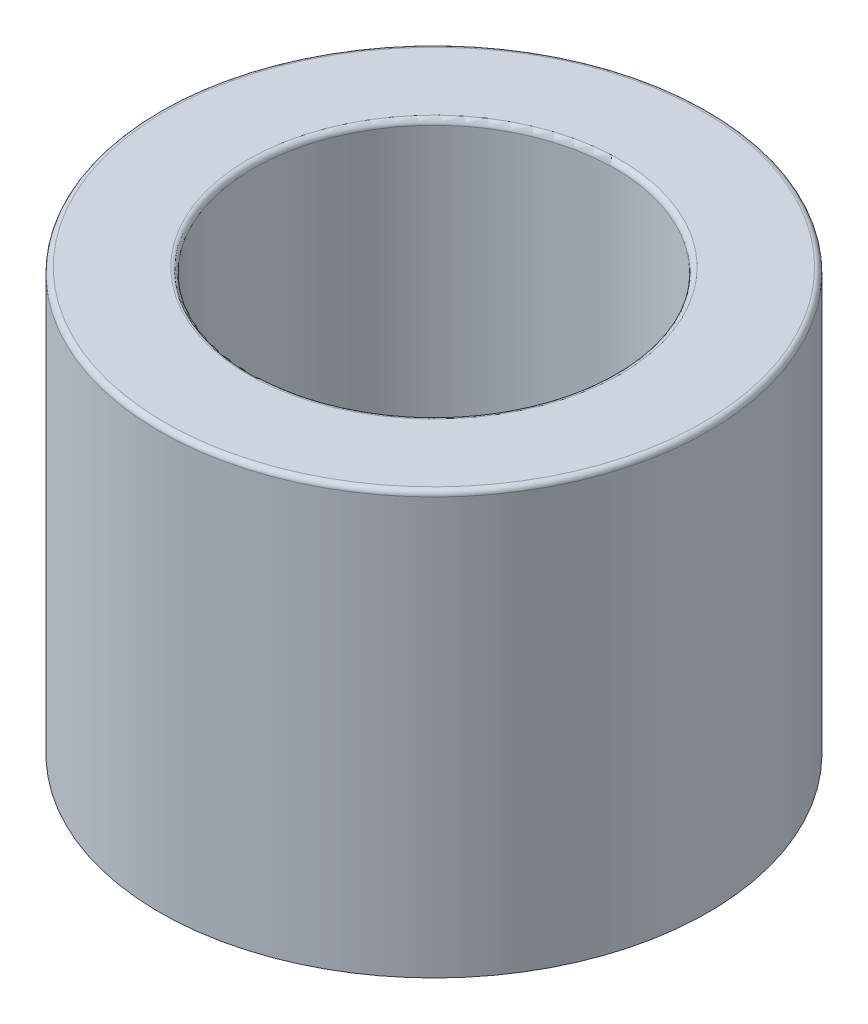
ISO-10303-21;
HEADER;
FILE_DESCRIPTION(('STEP AP214'),'2;1');
FILE_NAME('part.step','',(''),(''),'','','');
FILE_SCHEMA(('AUTOMOTIVE_DESIGN { 1 0 10303 214 1 1 1 1 }'));
ENDSEC;
DATA;
#1=APPLICATION_CONTEXT('core data for automotive mechanical design processes');
#2=APPLICATION_PROTOCOL_DEFINITION('international standard','automotive_design',2000,#1);
#3=PRODUCT_CONTEXT('',#1,'mechanical');
#4=PRODUCT('Part','Part','',(#3));
#5=PRODUCT_RELATED_PRODUCT_CATEGORY('part','',(#4));
#6=PRODUCT_DEFINITION_FORMATION('','',#4);
#7=PRODUCT_DEFINITION_CONTEXT('part definition',#1,'design');
#8=PRODUCT_DEFINITION('design','',#6,#7);
#9=PRODUCT_DEFINITION_SHAPE('','',#8);
#10=(LENGTH_UNIT() NAMED_UNIT(*) SI_UNIT(.MILLI.,.METRE.));
#11=(NAMED_UNIT(*) PLANE_ANGLE_UNIT() SI_UNIT($,.RADIAN.));
#12=(NAMED_UNIT(*) SI_UNIT($,.STERADIAN.) SOLID_ANGLE_UNIT());
#13=UNCERTAINTY_MEASURE_WITH_UNIT(LENGTH_MEASURE(1.E-05),#10,'distance_accuracy_value','');
#14=(GEOMETRIC_REPRESENTATION_CONTEXT(3) GLOBAL_UNCERTAINTY_ASSIGNED_CONTEXT((#13)) GLOBAL_UNIT_ASSIGNED_CONTEXT((#10,
#11,#12)) REPRESENTATION_CONTEXT('',''));
#15=CARTESIAN_POINT('',(0.,0.,0.));
#16=DIRECTION('',(0.,0.,1.));
#17=DIRECTION('',(1.,0.,0.));
#18=AXIS2_PLACEMENT_3D('',#15,#16,#17);
#19=CARTESIAN_POINT('',(0.237499999999891,-4.88975000000003,0.));
#20=DIRECTION('',(0.,-1.,0.));
#21=DIRECTION('',(1.,0.,0.));
#22=AXIS2_PLACEMENT_3D('',#19,#20,#21);
#23=PLANE('',#22);
#24=CARTESIAN_POINT('',(0.237499999999891,-4.88975000000003,0.));
#25=DIRECTION('',(0.,1.,0.));
#26=DIRECTION('',(-1.,0.,0.));
#27=AXIS2_PLACEMENT_3D('',#24,#25,#26);
#28=CIRCLE('',#27,7.58125);
#29=CARTESIAN_POINT('',(-7.34375000000012,-4.88975000000003,0.));
#30=VERTEX_POINT('',#29);
#31=EDGE_CURVE('E69',#30,#30,#28,.T.);
#32=ORIENTED_EDGE('',*,*,#31,.F.);
#33=EDGE_LOOP('',(#32));
#34=FACE_BOUND('',#33,.T.);
#35=ADVANCED_FACE('F43',(#34),#23,.T.);
#36=CARTESIAN_POINT('',(0.237499999999891,-0.793749999999982,0.));
#37=DIRECTION('',(0.,1.,0.));
#38=DIRECTION('',(-1.,0.,0.));
#39=AXIS2_PLACEMENT_3D('',#36,#37,#38);
#40=CYLINDRICAL_SURFACE('',#39,7.58125);
#41=CARTESIAN_POINT('',(0.237499999999891,6.61962500000007,0.));
#42=DIRECTION('',(0.,1.,0.));
#43=DIRECTION('',(-1.,0.,0.));
#44=AXIS2_PLACEMENT_3D('',#41,#42,#43);
#45=CIRCLE('',#44,7.58125);
#46=CARTESIAN_POINT('',(-7.34375000000012,6.61962500000007,0.));
#47=VERTEX_POINT('',#46);
#48=EDGE_CURVE('E51',#47,#47,#45,.F.);
#49=ORIENTED_EDGE('',*,*,#48,.T.);
#50=EDGE_LOOP('',(#49));
#51=FACE_BOUND('',#50,.T.);
#52=ORIENTED_EDGE('',*,*,#31,.T.);
#53=EDGE_LOOP('',(#52));
#54=FACE_BOUND('',#53,.T.);
#55=ADVANCED_FACE('F91',(#51,#54),#40,.T.);
#56=CARTESIAN_POINT('',(-7.34374999999998,6.76250000000017,-6.66133814775094E-13));
#57=DIRECTION('',(0.,1.,0.));
#58=DIRECTION('',(-1.,0.,0.));
#59=AXIS2_PLACEMENT_3D('',#56,#57,#58);
#60=PLANE('',#59);
#61=CARTESIAN_POINT('',(0.237499999999891,6.76250000000017,0.));
#62=DIRECTION('',(0.,1.,0.));
#63=DIRECTION('',(-1.,0.,0.));
#64=AXIS2_PLACEMENT_3D('',#61,#62,#63);
#65=CIRCLE('',#64,7.438375);
#66=CARTESIAN_POINT('',(-7.20087500000012,6.76250000000017,0.));
#67=VERTEX_POINT('',#66);
#68=EDGE_CURVE('E57',#67,#67,#65,.T.);
#69=ORIENTED_EDGE('',*,*,#68,.T.);
#70=EDGE_LOOP('',(#69));
#71=FACE_BOUND('',#70,.T.);
#72=CARTESIAN_POINT('',(0.237499999999891,6.76250000000017,0.));
#73=DIRECTION('',(0.,1.,0.));
#74=DIRECTION('',(-1.,0.,0.));
#75=AXIS2_PLACEMENT_3D('',#72,#73,#74);
#76=CIRCLE('',#75,5.142875);
#77=CARTESIAN_POINT('',(-4.90537500000011,6.76250000000017,0.));
#78=VERTEX_POINT('',#77);
#79=EDGE_CURVE('E63',#78,#78,#76,.F.);
#80=ORIENTED_EDGE('',*,*,#79,.T.);
#81=EDGE_LOOP('',(#80));
#82=FACE_BOUND('',#81,.T.);
#83=ADVANCED_FACE('F83',(#71,#82),#60,.T.);
#84=CARTESIAN_POINT('',(0.237499999999891,-0.793749999999982,0.));
#85=DIRECTION('',(0.,1.,0.));
#86=DIRECTION('',(-1.,0.,0.));
#87=AXIS2_PLACEMENT_3D('',#84,#85,#86);
#88=CYLINDRICAL_SURFACE('',#87,5.);
#89=CARTESIAN_POINT('',(0.237499999999891,6.61962500000007,0.));
#90=DIRECTION('',(0.,1.,0.));
#91=DIRECTION('',(-1.,0.,0.));
#92=AXIS2_PLACEMENT_3D('',#89,#90,#91);
#93=CIRCLE('',#92,5.);
#94=CARTESIAN_POINT('',(-4.76250000000011,6.61962500000007,0.));
#95=VERTEX_POINT('',#94);
#96=EDGE_CURVE('E10',#95,#95,#93,.T.);
#97=ORIENTED_EDGE('',*,*,#96,.T.);
#98=EDGE_LOOP('',(#97));
#99=FACE_BOUND('',#98,.T.);
#100=CARTESIAN_POINT('',(0.237499999999891,-0.793749999999982,0.));
#101=DIRECTION('',(0.,1.,0.));
#102=DIRECTION('',(-1.,0.,0.));
#103=AXIS2_PLACEMENT_3D('',#100,#101,#102);
#104=CIRCLE('',#103,5.);
#105=CARTESIAN_POINT('',(-4.76250000000011,-0.793749999999983,0.));
#106=VERTEX_POINT('',#105);
#107=EDGE_CURVE('E73',#106,#106,#104,.T.);
#108=ORIENTED_EDGE('',*,*,#107,.F.);
#109=EDGE_LOOP('',(#108));
#110=FACE_BOUND('',#109,.T.);
#111=ADVANCED_FACE('F81',(#99,#110),#88,.F.);
#112=CARTESIAN_POINT('',(-4.76250000000022,-0.793749999999982,0.));
#113=DIRECTION('',(0.,1.,0.));
#114=DIRECTION('',(-1.,0.,0.));
#115=AXIS2_PLACEMENT_3D('',#112,#113,#114);
#116=PLANE('',#115);
#117=ORIENTED_EDGE('',*,*,#107,.T.);
#118=EDGE_LOOP('',(#117));
#119=FACE_BOUND('',#118,.T.);
#120=ADVANCED_FACE('F79',(#119),#116,.T.);
#121=CARTESIAN_POINT('',(0.237499999999891,6.61962500000007,0.));
#122=DIRECTION('',(0.,1.,0.));
#123=DIRECTION('',(-1.,0.,0.));
#124=AXIS2_PLACEMENT_3D('',#121,#122,#123);
#125=TOROIDAL_SURFACE('',#124,7.438375,0.142875);
#126=ORIENTED_EDGE('',*,*,#48,.F.);
#127=EDGE_LOOP('',(#126));
#128=FACE_BOUND('',#127,.T.);
#129=ORIENTED_EDGE('',*,*,#68,.F.);
#130=EDGE_LOOP('',(#129));
#131=FACE_BOUND('',#130,.T.);
#132=ADVANCED_FACE('F89',(#128,#131),#125,.T.);
#133=CARTESIAN_POINT('',(0.237499999999891,6.61962500000007,0.));
#134=DIRECTION('',(0.,1.,0.));
#135=DIRECTION('',(-1.,0.,0.));
#136=AXIS2_PLACEMENT_3D('',#133,#134,#135);
#137=TOROIDAL_SURFACE('',#136,5.142875,0.142875);
#138=ORIENTED_EDGE('',*,*,#79,.F.);
#139=EDGE_LOOP('',(#138));
#140=FACE_BOUND('',#139,.T.);
#141=ORIENTED_EDGE('',*,*,#96,.F.);
#142=EDGE_LOOP('',(#141));
#143=FACE_BOUND('',#142,.T.);
#144=ADVANCED_FACE('F45',(#140,#143),#137,.T.);
#145=CLOSED_SHELL('',(#35,#55,#83,#111,#120,#132,#144));
#146=MANIFOLD_SOLID_BREP('B2',#145);
#147=ADVANCED_BREP_SHAPE_REPRESENTATION('',(#18,#146),#14);
#148=SHAPE_DEFINITION_REPRESENTATION(#9,#147);
ENDSEC;
END-ISO-10303-21;
